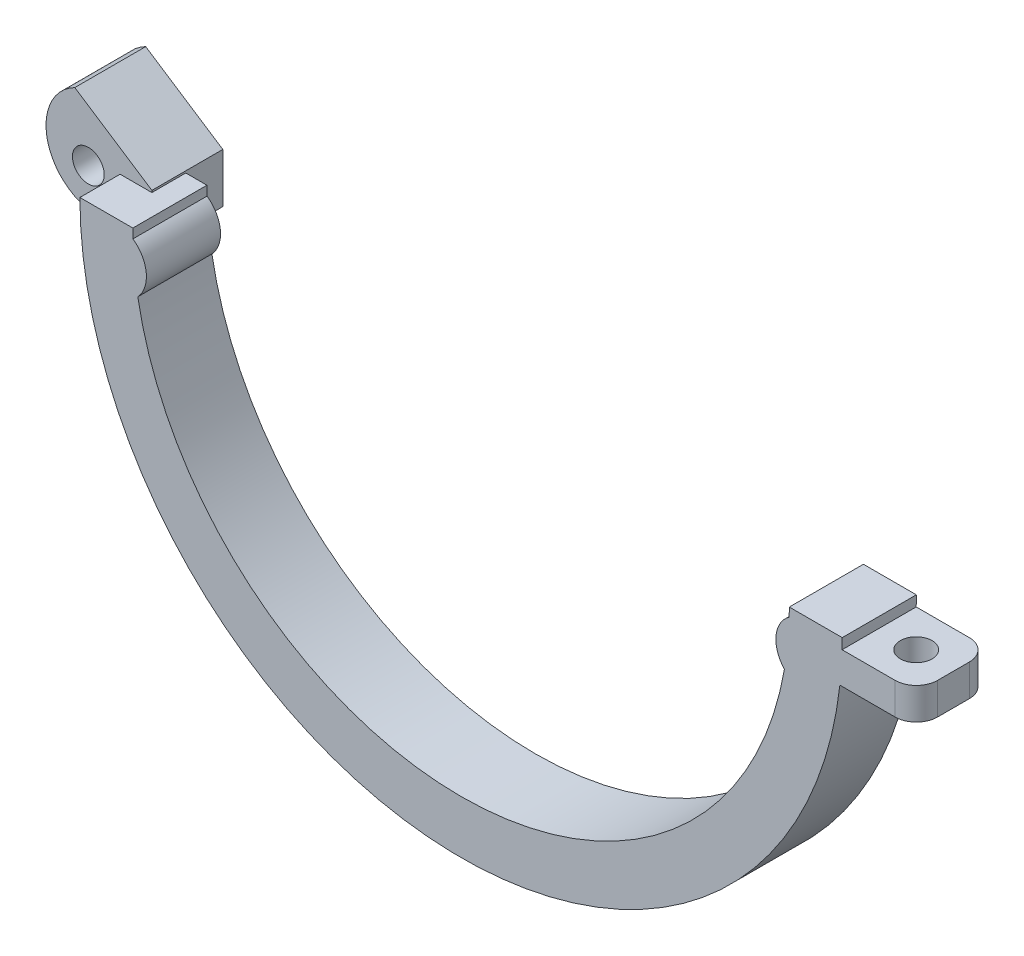
ISO-10303-21;
HEADER;
FILE_DESCRIPTION(('STEP AP214'),'2;1');
FILE_NAME('part.step','',(''),(''),'','','');
FILE_SCHEMA(('AUTOMOTIVE_DESIGN { 1 0 10303 214 1 1 1 1 }'));
ENDSEC;
DATA;
#1=APPLICATION_CONTEXT('core data for automotive mechanical design processes');
#2=APPLICATION_PROTOCOL_DEFINITION('international standard','automotive_design',2000,#1);
#3=PRODUCT_CONTEXT('',#1,'mechanical');
#4=PRODUCT('Part','Part','',(#3));
#5=PRODUCT_RELATED_PRODUCT_CATEGORY('part','',(#4));
#6=PRODUCT_DEFINITION_FORMATION('','',#4);
#7=PRODUCT_DEFINITION_CONTEXT('part definition',#1,'design');
#8=PRODUCT_DEFINITION('design','',#6,#7);
#9=PRODUCT_DEFINITION_SHAPE('','',#8);
#10=(LENGTH_UNIT() NAMED_UNIT(*) SI_UNIT(.MILLI.,.METRE.));
#11=(NAMED_UNIT(*) PLANE_ANGLE_UNIT() SI_UNIT($,.RADIAN.));
#12=(NAMED_UNIT(*) SI_UNIT($,.STERADIAN.) SOLID_ANGLE_UNIT());
#13=UNCERTAINTY_MEASURE_WITH_UNIT(LENGTH_MEASURE(1.E-05),#10,'distance_accuracy_value','');
#14=(GEOMETRIC_REPRESENTATION_CONTEXT(3) GLOBAL_UNCERTAINTY_ASSIGNED_CONTEXT((#13)) GLOBAL_UNIT_ASSIGNED_CONTEXT((#10,
#11,#12)) REPRESENTATION_CONTEXT('',''));
#15=CARTESIAN_POINT('',(0.,0.,0.));
#16=DIRECTION('',(0.,0.,1.));
#17=DIRECTION('',(1.,0.,0.));
#18=AXIS2_PLACEMENT_3D('',#15,#16,#17);
#19=CARTESIAN_POINT('',(41.,-3.99999999999988,2.));
#20=DIRECTION('',(0.,-1.,0.));
#21=DIRECTION('',(0.,0.,-1.));
#22=AXIS2_PLACEMENT_3D('',#19,#20,#21);
#23=CYLINDRICAL_SURFACE('',#22,2.);
#24=DIRECTION('',(0.,1.,0.));
#25=VECTOR('',#24,1.);
#26=CARTESIAN_POINT('',(43.,-3.99999999999988,2.));
#27=LINE('',#26,#25);
#28=CARTESIAN_POINT('',(43.,-3.99999999999988,2.));
#29=VERTEX_POINT('',#28);
#30=CARTESIAN_POINT('',(43.,-0.99999999999988,2.));
#31=VERTEX_POINT('',#30);
#32=EDGE_CURVE('E301',#29,#31,#27,.T.);
#33=ORIENTED_EDGE('',*,*,#32,.F.);
#34=CARTESIAN_POINT('',(41.,-3.99999999999988,2.));
#35=DIRECTION('',(0.,-1.,0.));
#36=DIRECTION('',(1.,0.,0.));
#37=AXIS2_PLACEMENT_3D('',#34,#35,#36);
#38=CIRCLE('',#37,2.);
#39=CARTESIAN_POINT('',(41.,-3.99999999999988,0.));
#40=VERTEX_POINT('',#39);
#41=EDGE_CURVE('E56',#40,#29,#38,.T.);
#42=ORIENTED_EDGE('',*,*,#41,.F.);
#43=DIRECTION('',(0.,1.,0.));
#44=VECTOR('',#43,1.);
#45=CARTESIAN_POINT('',(41.,-3.99999999999988,0.));
#46=LINE('',#45,#44);
#47=CARTESIAN_POINT('',(41.,-0.999999999999881,0.));
#48=VERTEX_POINT('',#47);
#49=EDGE_CURVE('E304',#48,#40,#46,.F.);
#50=ORIENTED_EDGE('',*,*,#49,.F.);
#51=CARTESIAN_POINT('',(41.,-0.999999999999881,2.));
#52=DIRECTION('',(0.,1.,0.));
#53=DIRECTION('',(-1.,0.,0.));
#54=AXIS2_PLACEMENT_3D('',#51,#52,#53);
#55=CIRCLE('',#54,2.);
#56=EDGE_CURVE('E42',#31,#48,#55,.T.);
#57=ORIENTED_EDGE('',*,*,#56,.F.);
#58=EDGE_LOOP('',(#33,#42,#50,#57));
#59=FACE_BOUND('',#58,.T.);
#60=ADVANCED_FACE('F35',(#59),#23,.T.);
#61=CARTESIAN_POINT('',(41.,0.,5.));
#62=DIRECTION('',(0.,1.,0.));
#63=DIRECTION('',(0.,0.,1.));
#64=AXIS2_PLACEMENT_3D('',#61,#62,#63);
#65=CYLINDRICAL_SURFACE('',#64,2.);
#66=DIRECTION('',(0.,1.,0.));
#67=VECTOR('',#66,1.);
#68=CARTESIAN_POINT('',(41.,0.,7.));
#69=LINE('',#68,#67);
#70=CARTESIAN_POINT('',(41.,-3.99999999999988,7.));
#71=VERTEX_POINT('',#70);
#72=CARTESIAN_POINT('',(41.,-0.999999999999881,7.));
#73=VERTEX_POINT('',#72);
#74=EDGE_CURVE('E290',#71,#73,#69,.T.);
#75=ORIENTED_EDGE('',*,*,#74,.F.);
#76=CARTESIAN_POINT('',(41.,-3.99999999999988,5.));
#77=DIRECTION('',(0.,-1.,0.));
#78=DIRECTION('',(1.,0.,0.));
#79=AXIS2_PLACEMENT_3D('',#76,#77,#78);
#80=CIRCLE('',#79,2.);
#81=CARTESIAN_POINT('',(43.,-3.99999999999988,5.));
#82=VERTEX_POINT('',#81);
#83=EDGE_CURVE('E296',#82,#71,#80,.T.);
#84=ORIENTED_EDGE('',*,*,#83,.F.);
#85=DIRECTION('',(0.,1.,0.));
#86=VECTOR('',#85,1.);
#87=CARTESIAN_POINT('',(43.,-3.99999999999988,5.));
#88=LINE('',#87,#86);
#89=CARTESIAN_POINT('',(43.,-0.99999999999988,5.));
#90=VERTEX_POINT('',#89);
#91=EDGE_CURVE('E293',#90,#82,#88,.F.);
#92=ORIENTED_EDGE('',*,*,#91,.F.);
#93=CARTESIAN_POINT('',(41.,-0.999999999999881,5.));
#94=DIRECTION('',(0.,1.,0.));
#95=DIRECTION('',(-1.,0.,0.));
#96=AXIS2_PLACEMENT_3D('',#93,#94,#95);
#97=CIRCLE('',#96,2.);
#98=EDGE_CURVE('E298',#73,#90,#97,.T.);
#99=ORIENTED_EDGE('',*,*,#98,.F.);
#100=EDGE_LOOP('',(#75,#84,#92,#99));
#101=FACE_BOUND('',#100,.T.);
#102=ADVANCED_FACE('F402',(#101),#65,.T.);
#103=CARTESIAN_POINT('',(0.,0.,7.));
#104=DIRECTION('',(0.,0.,-1.));
#105=DIRECTION('',(-1.,0.,0.));
#106=AXIS2_PLACEMENT_3D('',#103,#104,#105);
#107=CYLINDRICAL_SURFACE('',#106,36.);
#108=CARTESIAN_POINT('',(0.,0.,0.));
#109=DIRECTION('',(0.,0.,1.));
#110=DIRECTION('',(1.,0.,0.));
#111=AXIS2_PLACEMENT_3D('',#108,#109,#110);
#112=CIRCLE('',#111,36.);
#113=CARTESIAN_POINT('',(-35.717642699372,-4.50000000000014,0.));
#114=VERTEX_POINT('',#113);
#115=CARTESIAN_POINT('',(35.7770876399966,-3.99999999999988,0.));
#116=VERTEX_POINT('',#115);
#117=EDGE_CURVE('E248',#114,#116,#112,.T.);
#118=ORIENTED_EDGE('',*,*,#117,.T.);
#119=DIRECTION('',(0.,0.,-1.));
#120=VECTOR('',#119,1.);
#121=CARTESIAN_POINT('',(35.7770876399966,-3.99999999999988,7.));
#122=LINE('',#121,#120);
#123=CARTESIAN_POINT('',(35.7770876399966,-3.99999999999988,7.));
#124=VERTEX_POINT('',#123);
#125=EDGE_CURVE('E337',#116,#124,#122,.F.);
#126=ORIENTED_EDGE('',*,*,#125,.T.);
#127=CARTESIAN_POINT('',(0.,0.,7.));
#128=DIRECTION('',(0.,0.,1.));
#129=DIRECTION('',(1.,0.,0.));
#130=AXIS2_PLACEMENT_3D('',#127,#128,#129);
#131=CIRCLE('',#130,36.);
#132=CARTESIAN_POINT('',(-36.,-1.38919513629144E-13,7.));
#133=VERTEX_POINT('',#132);
#134=EDGE_CURVE('E232',#133,#124,#131,.T.);
#135=ORIENTED_EDGE('',*,*,#134,.F.);
#136=DIRECTION('',(0.,0.,-1.));
#137=VECTOR('',#136,1.);
#138=CARTESIAN_POINT('',(-36.,-1.38919513629144E-13,7.));
#139=LINE('',#138,#137);
#140=CARTESIAN_POINT('',(-36.,-1.38919513629144E-13,3.2));
#141=VERTEX_POINT('',#140);
#142=EDGE_CURVE('E256',#133,#141,#139,.T.);
#143=ORIENTED_EDGE('',*,*,#142,.T.);
#144=CARTESIAN_POINT('',(0.,0.,3.2));
#145=DIRECTION('',(0.,0.,1.));
#146=DIRECTION('',(1.,0.,0.));
#147=AXIS2_PLACEMENT_3D('',#144,#145,#146);
#148=CIRCLE('',#147,36.);
#149=CARTESIAN_POINT('',(-35.717642699372,-4.50000000000014,3.2));
#150=VERTEX_POINT('',#149);
#151=EDGE_CURVE('E275',#141,#150,#148,.T.);
#152=ORIENTED_EDGE('',*,*,#151,.T.);
#153=DIRECTION('',(0.,0.,-1.));
#154=VECTOR('',#153,1.);
#155=CARTESIAN_POINT('',(-35.717642699372,-4.50000000000014,7.));
#156=LINE('',#155,#154);
#157=EDGE_CURVE('E207',#114,#150,#156,.F.);
#158=ORIENTED_EDGE('',*,*,#157,.F.);
#159=EDGE_LOOP('',(#118,#126,#135,#143,#152,#158));
#160=FACE_BOUND('',#159,.T.);
#161=ADVANCED_FACE('F356',(#160),#107,.T.);
#162=CARTESIAN_POINT('',(-38.,0.499999999999861,-3.5));
#163=DIRECTION('',(0.,0.,-1.));
#164=DIRECTION('',(-1.,0.,0.));
#165=AXIS2_PLACEMENT_3D('',#162,#163,#164);
#166=CYLINDRICAL_SURFACE('',#165,5.);
#167=DIRECTION('',(0.,0.,-1.));
#168=VECTOR('',#167,1.);
#169=CARTESIAN_POINT('',(-38.,-4.50000000000014,-3.5));
#170=LINE('',#169,#168);
#171=CARTESIAN_POINT('',(-38.,-4.50000000000014,3.2));
#172=VERTEX_POINT('',#171);
#173=CARTESIAN_POINT('',(-38.,-4.50000000000014,-3.5));
#174=VERTEX_POINT('',#173);
#175=EDGE_CURVE('E283',#172,#174,#170,.T.);
#176=ORIENTED_EDGE('',*,*,#175,.F.);
#177=CARTESIAN_POINT('',(-38.,0.499999999999861,3.2));
#178=DIRECTION('',(0.,0.,1.));
#179=DIRECTION('',(1.,0.,0.));
#180=AXIS2_PLACEMENT_3D('',#177,#178,#179);
#181=CIRCLE('',#180,5.);
#182=CARTESIAN_POINT('',(-43.,0.499999999999861,3.2));
#183=VERTEX_POINT('',#182);
#184=EDGE_CURVE('E286',#183,#172,#181,.T.);
#185=ORIENTED_EDGE('',*,*,#184,.F.);
#186=DIRECTION('',(0.,0.,-1.));
#187=VECTOR('',#186,1.);
#188=CARTESIAN_POINT('',(-43.,0.499999999999861,-3.5));
#189=LINE('',#188,#187);
#190=CARTESIAN_POINT('',(-43.,0.499999999999861,-3.5));
#191=VERTEX_POINT('',#190);
#192=EDGE_CURVE('E277',#183,#191,#189,.T.);
#193=ORIENTED_EDGE('',*,*,#192,.T.);
#194=CARTESIAN_POINT('',(-38.,0.499999999999861,-3.5));
#195=DIRECTION('',(0.,0.,1.));
#196=DIRECTION('',(1.,0.,0.));
#197=AXIS2_PLACEMENT_3D('',#194,#195,#196);
#198=CIRCLE('',#197,5.);
#199=EDGE_CURVE('E288',#174,#191,#198,.F.);
#200=ORIENTED_EDGE('',*,*,#199,.F.);
#201=EDGE_LOOP('',(#176,#185,#193,#200));
#202=FACE_BOUND('',#201,.T.);
#203=ADVANCED_FACE('F428',(#202),#166,.T.);
#204=CARTESIAN_POINT('',(-38.,0.499999999999861,-3.5));
#205=DIRECTION('',(0.,0.,-1.));
#206=DIRECTION('',(-1.,0.,0.));
#207=AXIS2_PLACEMENT_3D('',#204,#205,#206);
#208=CYLINDRICAL_SURFACE('',#207,5.);
#209=DIRECTION('',(0.,0.,-1.));
#210=VECTOR('',#209,1.);
#211=CARTESIAN_POINT('',(-40.2798012873395,4.95000068429703,3.49999999999999));
#212=LINE('',#211,#210);
#213=CARTESIAN_POINT('',(-40.2798012873395,4.95000068429703,3.2));
#214=VERTEX_POINT('',#213);
#215=CARTESIAN_POINT('',(-40.2798012873395,4.95000068429703,-3.5));
#216=VERTEX_POINT('',#215);
#217=EDGE_CURVE('E48',#214,#216,#212,.T.);
#218=ORIENTED_EDGE('',*,*,#217,.T.);
#219=CARTESIAN_POINT('',(-38.,0.499999999999861,-3.5));
#220=DIRECTION('',(0.,0.,1.));
#221=DIRECTION('',(1.,0.,0.));
#222=AXIS2_PLACEMENT_3D('',#219,#220,#221);
#223=CIRCLE('',#222,5.);
#224=EDGE_CURVE('E190',#191,#216,#223,.F.);
#225=ORIENTED_EDGE('',*,*,#224,.F.);
#226=ORIENTED_EDGE('',*,*,#192,.F.);
#227=CARTESIAN_POINT('',(-38.,0.499999999999861,3.2));
#228=DIRECTION('',(0.,0.,1.));
#229=DIRECTION('',(1.,0.,0.));
#230=AXIS2_PLACEMENT_3D('',#227,#228,#229);
#231=CIRCLE('',#230,5.);
#232=EDGE_CURVE('E280',#214,#183,#231,.T.);
#233=ORIENTED_EDGE('',*,*,#232,.F.);
#234=EDGE_LOOP('',(#218,#225,#226,#233));
#235=FACE_BOUND('',#234,.T.);
#236=ADVANCED_FACE('F433',(#235),#208,.T.);
#237=CARTESIAN_POINT('',(0.,0.,7.));
#238=DIRECTION('',(0.,1.,0.));
#239=DIRECTION('',(-1.,0.,0.));
#240=AXIS2_PLACEMENT_3D('',#237,#238,#239);
#241=PLANE('',#240);
#242=DIRECTION('',(1.,0.,0.));
#243=VECTOR('',#242,1.);
#244=CARTESIAN_POINT('',(0.,0.,0.));
#245=LINE('',#244,#243);
#246=CARTESIAN_POINT('',(-33.,-1.27342887493382E-13,0.));
#247=VERTEX_POINT('',#246);
#248=CARTESIAN_POINT('',(-31.,-1.19625136736208E-13,0.));
#249=VERTEX_POINT('',#248);
#250=EDGE_CURVE('E245',#247,#249,#245,.T.);
#251=ORIENTED_EDGE('',*,*,#250,.F.);
#252=DIRECTION('',(0.,0.,1.));
#253=VECTOR('',#252,1.);
#254=CARTESIAN_POINT('',(-33.,-1.27342887493382E-13,7.));
#255=LINE('',#254,#253);
#256=CARTESIAN_POINT('',(-33.,-1.27342887493382E-13,3.2));
#257=VERTEX_POINT('',#256);
#258=EDGE_CURVE('E210',#247,#257,#255,.T.);
#259=ORIENTED_EDGE('',*,*,#258,.T.);
#260=DIRECTION('',(1.,0.,0.));
#261=VECTOR('',#260,1.);
#262=CARTESIAN_POINT('',(0.,0.,3.2));
#263=LINE('',#262,#261);
#264=EDGE_CURVE('E213',#141,#257,#263,.T.);
#265=ORIENTED_EDGE('',*,*,#264,.F.);
#266=ORIENTED_EDGE('',*,*,#142,.F.);
#267=DIRECTION('',(1.,0.,0.));
#268=VECTOR('',#267,1.);
#269=CARTESIAN_POINT('',(0.,0.,7.));
#270=LINE('',#269,#268);
#271=CARTESIAN_POINT('',(-31.,-1.19625136736208E-13,7.));
#272=VERTEX_POINT('',#271);
#273=EDGE_CURVE('E227',#133,#272,#270,.T.);
#274=ORIENTED_EDGE('',*,*,#273,.T.);
#275=DIRECTION('',(0.,0.,-1.));
#276=VECTOR('',#275,1.);
#277=CARTESIAN_POINT('',(-31.,-1.19625136736208E-13,7.));
#278=LINE('',#277,#276);
#279=EDGE_CURVE('E259',#272,#249,#278,.T.);
#280=ORIENTED_EDGE('',*,*,#279,.T.);
#281=EDGE_LOOP('',(#251,#259,#265,#266,#274,#280));
#282=FACE_BOUND('',#281,.T.);
#283=ADVANCED_FACE('F349',(#282),#241,.T.);
#284=CARTESIAN_POINT('',(35.9861084308932,-0.999999999999881,7.));
#285=VERTEX_POINT('',#284);
#286=CARTESIAN_POINT('',(36.,1.38919513629144E-13,7.));
#287=VERTEX_POINT('',#286);
#288=EDGE_CURVE('E230',#285,#287,#131,.T.);
#289=ORIENTED_EDGE('',*,*,#288,.F.);
#290=DIRECTION('',(0.,0.,-1.));
#291=VECTOR('',#290,1.);
#292=CARTESIAN_POINT('',(35.9861084308932,-0.999999999999881,7.));
#293=LINE('',#292,#291);
#294=CARTESIAN_POINT('',(35.9861084308932,-0.999999999999881,0.));
#295=VERTEX_POINT('',#294);
#296=EDGE_CURVE('E334',#285,#295,#293,.T.);
#297=ORIENTED_EDGE('',*,*,#296,.T.);
#298=CARTESIAN_POINT('',(36.,1.38919513629144E-13,0.));
#299=VERTEX_POINT('',#298);
#300=EDGE_CURVE('E247',#295,#299,#112,.T.);
#301=ORIENTED_EDGE('',*,*,#300,.T.);
#302=DIRECTION('',(0.,0.,-1.));
#303=VECTOR('',#302,1.);
#304=CARTESIAN_POINT('',(36.,1.38919513629144E-13,7.));
#305=LINE('',#304,#303);
#306=EDGE_CURVE('E253',#287,#299,#305,.T.);
#307=ORIENTED_EDGE('',*,*,#306,.F.);
#308=EDGE_LOOP('',(#289,#297,#301,#307));
#309=FACE_BOUND('',#308,.T.);
#310=ADVANCED_FACE('F396',(#309),#107,.T.);
#311=CARTESIAN_POINT('',(0.,0.,0.));
#312=DIRECTION('',(0.,0.,1.));
#313=DIRECTION('',(1.,0.,0.));
#314=AXIS2_PLACEMENT_3D('',#311,#312,#313);
#315=PLANE('',#314);
#316=DIRECTION('',(-1.,0.,0.));
#317=VECTOR('',#316,1.);
#318=CARTESIAN_POINT('',(43.,-0.99999999999988,0.));
#319=LINE('',#318,#317);
#320=EDGE_CURVE('E311',#48,#295,#319,.T.);
#321=ORIENTED_EDGE('',*,*,#320,.F.);
#322=ORIENTED_EDGE('',*,*,#49,.T.);
#323=DIRECTION('',(1.,0.,0.));
#324=VECTOR('',#323,1.);
#325=CARTESIAN_POINT('',(43.,-3.99999999999988,0.));
#326=LINE('',#325,#324);
#327=EDGE_CURVE('E320',#116,#40,#326,.T.);
#328=ORIENTED_EDGE('',*,*,#327,.F.);
#329=ORIENTED_EDGE('',*,*,#117,.F.);
#330=DIRECTION('',(-1.,0.,0.));
#331=VECTOR('',#330,1.);
#332=CARTESIAN_POINT('',(0.,-4.50000000000014,0.));
#333=LINE('',#332,#331);
#334=CARTESIAN_POINT('',(-33.,-4.50000000000014,0.));
#335=VERTEX_POINT('',#334);
#336=EDGE_CURVE('E270',#335,#114,#333,.T.);
#337=ORIENTED_EDGE('',*,*,#336,.F.);
#338=DIRECTION('',(0.,-1.,0.));
#339=VECTOR('',#338,1.);
#340=CARTESIAN_POINT('',(-33.,0.,0.));
#341=LINE('',#340,#339);
#342=EDGE_CURVE('E273',#247,#335,#341,.T.);
#343=ORIENTED_EDGE('',*,*,#342,.F.);
#344=ORIENTED_EDGE('',*,*,#250,.T.);
#345=CARTESIAN_POINT('',(0.,0.,0.));
#346=DIRECTION('',(0.,0.,1.));
#347=DIRECTION('',(1.,0.,0.));
#348=AXIS2_PLACEMENT_3D('',#345,#346,#347);
#349=CIRCLE('',#348,31.);
#350=CARTESIAN_POINT('',(-30.9874565828908,-0.881779180666261,0.));
#351=VERTEX_POINT('',#350);
#352=EDGE_CURVE('E238',#249,#351,#349,.T.);
#353=ORIENTED_EDGE('',*,*,#352,.T.);
#354=CARTESIAN_POINT('',(-32.7162886303256,-3.33354176129319,0.));
#355=DIRECTION('',(0.,0.,1.));
#356=DIRECTION('',(1.,0.,0.));
#357=AXIS2_PLACEMENT_3D('',#354,#355,#356);
#358=CIRCLE('',#357,3.);
#359=CARTESIAN_POINT('',(-30.5284872887118,-5.38622909492017,0.));
#360=VERTEX_POINT('',#359);
#361=EDGE_CURVE('E242',#360,#351,#358,.T.);
#362=ORIENTED_EDGE('',*,*,#361,.F.);
#363=CARTESIAN_POINT('',(30.539836630561,-5.32150153421428,0.));
#364=VERTEX_POINT('',#363);
#365=EDGE_CURVE('E239',#360,#364,#349,.T.);
#366=ORIENTED_EDGE('',*,*,#365,.T.);
#367=CARTESIAN_POINT('',(32.7312790320065,-3.2727018365506,0.));
#368=DIRECTION('',(0.,0.,1.));
#369=DIRECTION('',(1.,0.,0.));
#370=AXIS2_PLACEMENT_3D('',#367,#368,#369);
#371=CIRCLE('',#370,3.);
#372=CARTESIAN_POINT('',(30.9888714898245,-0.830568351880452,0.));
#373=VERTEX_POINT('',#372);
#374=EDGE_CURVE('E237',#373,#364,#371,.T.);
#375=ORIENTED_EDGE('',*,*,#374,.F.);
#376=CARTESIAN_POINT('',(31.,1.19625136736207E-13,0.));
#377=VERTEX_POINT('',#376);
#378=EDGE_CURVE('E216',#373,#377,#349,.T.);
#379=ORIENTED_EDGE('',*,*,#378,.T.);
#380=EDGE_CURVE('E221',#377,#299,#245,.T.);
#381=ORIENTED_EDGE('',*,*,#380,.T.);
#382=ORIENTED_EDGE('',*,*,#300,.F.);
#383=EDGE_LOOP('',(#321,#322,#328,#329,#337,#343,#344,#353,#362,#366,#375,#379,#381,#382));
#384=FACE_BOUND('',#383,.T.);
#385=ADVANCED_FACE('F318',(#384),#315,.F.);
#386=CARTESIAN_POINT('',(0.,0.,7.));
#387=DIRECTION('',(0.,0.,-1.));
#388=DIRECTION('',(-1.,0.,0.));
#389=AXIS2_PLACEMENT_3D('',#386,#387,#388);
#390=CYLINDRICAL_SURFACE('',#389,31.);
#391=ORIENTED_EDGE('',*,*,#378,.F.);
#392=DIRECTION('',(0.,0.,-1.));
#393=VECTOR('',#392,1.);
#394=CARTESIAN_POINT('',(30.9888714898245,-0.830568351880452,7.));
#395=LINE('',#394,#393);
#396=CARTESIAN_POINT('',(30.9888714898245,-0.830568351880452,7.));
#397=VERTEX_POINT('',#396);
#398=EDGE_CURVE('E268',#397,#373,#395,.T.);
#399=ORIENTED_EDGE('',*,*,#398,.F.);
#400=CARTESIAN_POINT('',(0.,0.,7.));
#401=DIRECTION('',(0.,0.,1.));
#402=DIRECTION('',(1.,0.,0.));
#403=AXIS2_PLACEMENT_3D('',#400,#401,#402);
#404=CIRCLE('',#403,31.);
#405=CARTESIAN_POINT('',(31.,1.19625136736207E-13,7.));
#406=VERTEX_POINT('',#405);
#407=EDGE_CURVE('E217',#397,#406,#404,.T.);
#408=ORIENTED_EDGE('',*,*,#407,.T.);
#409=DIRECTION('',(0.,0.,-1.));
#410=VECTOR('',#409,1.);
#411=CARTESIAN_POINT('',(31.,1.19625136736207E-13,7.));
#412=LINE('',#411,#410);
#413=EDGE_CURVE('E251',#406,#377,#412,.T.);
#414=ORIENTED_EDGE('',*,*,#413,.T.);
#415=EDGE_LOOP('',(#391,#399,#408,#414));
#416=FACE_BOUND('',#415,.T.);
#417=ADVANCED_FACE('F387',(#416),#390,.F.);
#418=CARTESIAN_POINT('',(32.7312790320065,-3.2727018365506,7.));
#419=DIRECTION('',(0.,0.,-1.));
#420=DIRECTION('',(-1.,0.,0.));
#421=AXIS2_PLACEMENT_3D('',#418,#419,#420);
#422=CYLINDRICAL_SURFACE('',#421,3.);
#423=ORIENTED_EDGE('',*,*,#374,.T.);
#424=DIRECTION('',(0.,0.,-1.));
#425=VECTOR('',#424,1.);
#426=CARTESIAN_POINT('',(30.539836630561,-5.32150153421428,7.));
#427=LINE('',#426,#425);
#428=CARTESIAN_POINT('',(30.539836630561,-5.32150153421428,7.));
#429=VERTEX_POINT('',#428);
#430=EDGE_CURVE('E266',#429,#364,#427,.T.);
#431=ORIENTED_EDGE('',*,*,#430,.F.);
#432=CARTESIAN_POINT('',(32.7312790320065,-3.2727018365506,7.));
#433=DIRECTION('',(0.,0.,1.));
#434=DIRECTION('',(1.,0.,0.));
#435=AXIS2_PLACEMENT_3D('',#432,#433,#434);
#436=CIRCLE('',#435,3.);
#437=EDGE_CURVE('E220',#397,#429,#436,.T.);
#438=ORIENTED_EDGE('',*,*,#437,.F.);
#439=ORIENTED_EDGE('',*,*,#398,.T.);
#440=EDGE_LOOP('',(#423,#431,#438,#439));
#441=FACE_BOUND('',#440,.T.);
#442=ADVANCED_FACE('F384',(#441),#422,.T.);
#443=ORIENTED_EDGE('',*,*,#365,.F.);
#444=DIRECTION('',(0.,0.,-1.));
#445=VECTOR('',#444,1.);
#446=CARTESIAN_POINT('',(-30.5284872887118,-5.38622909492017,7.));
#447=LINE('',#446,#445);
#448=CARTESIAN_POINT('',(-30.5284872887118,-5.38622909492017,7.));
#449=VERTEX_POINT('',#448);
#450=EDGE_CURVE('E264',#449,#360,#447,.T.);
#451=ORIENTED_EDGE('',*,*,#450,.F.);
#452=EDGE_CURVE('E223',#449,#429,#404,.T.);
#453=ORIENTED_EDGE('',*,*,#452,.T.);
#454=ORIENTED_EDGE('',*,*,#430,.T.);
#455=EDGE_LOOP('',(#443,#451,#453,#454));
#456=FACE_BOUND('',#455,.T.);
#457=ADVANCED_FACE('F377',(#456),#390,.F.);
#458=CARTESIAN_POINT('',(-32.7162886303256,-3.33354176129319,7.));
#459=DIRECTION('',(0.,0.,-1.));
#460=DIRECTION('',(-1.,0.,0.));
#461=AXIS2_PLACEMENT_3D('',#458,#459,#460);
#462=CYLINDRICAL_SURFACE('',#461,3.);
#463=ORIENTED_EDGE('',*,*,#361,.T.);
#464=DIRECTION('',(0.,0.,-1.));
#465=VECTOR('',#464,1.);
#466=CARTESIAN_POINT('',(-30.9874565828908,-0.881779180666261,7.));
#467=LINE('',#466,#465);
#468=CARTESIAN_POINT('',(-30.9874565828908,-0.881779180666261,7.));
#469=VERTEX_POINT('',#468);
#470=EDGE_CURVE('E262',#469,#351,#467,.T.);
#471=ORIENTED_EDGE('',*,*,#470,.F.);
#472=CARTESIAN_POINT('',(-32.7162886303256,-3.33354176129319,7.));
#473=DIRECTION('',(0.,0.,1.));
#474=DIRECTION('',(1.,0.,0.));
#475=AXIS2_PLACEMENT_3D('',#472,#473,#474);
#476=CIRCLE('',#475,3.);
#477=EDGE_CURVE('E225',#449,#469,#476,.T.);
#478=ORIENTED_EDGE('',*,*,#477,.F.);
#479=ORIENTED_EDGE('',*,*,#450,.T.);
#480=EDGE_LOOP('',(#463,#471,#478,#479));
#481=FACE_BOUND('',#480,.T.);
#482=ADVANCED_FACE('F440',(#481),#462,.T.);
#483=ORIENTED_EDGE('',*,*,#352,.F.);
#484=ORIENTED_EDGE('',*,*,#279,.F.);
#485=EDGE_CURVE('E222',#272,#469,#404,.T.);
#486=ORIENTED_EDGE('',*,*,#485,.T.);
#487=ORIENTED_EDGE('',*,*,#470,.T.);
#488=EDGE_LOOP('',(#483,#484,#486,#487));
#489=FACE_BOUND('',#488,.T.);
#490=ADVANCED_FACE('F369',(#489),#390,.F.);
#491=ORIENTED_EDGE('',*,*,#380,.F.);
#492=ORIENTED_EDGE('',*,*,#413,.F.);
#493=EDGE_CURVE('E231',#406,#287,#270,.T.);
#494=ORIENTED_EDGE('',*,*,#493,.T.);
#495=ORIENTED_EDGE('',*,*,#306,.T.);
#496=EDGE_LOOP('',(#491,#492,#494,#495));
#497=FACE_BOUND('',#496,.T.);
#498=ADVANCED_FACE('F391',(#497),#241,.T.);
#499=CARTESIAN_POINT('',(0.,0.,7.));
#500=DIRECTION('',(0.,0.,1.));
#501=DIRECTION('',(1.,0.,0.));
#502=AXIS2_PLACEMENT_3D('',#499,#500,#501);
#503=PLANE('',#502);
#504=DIRECTION('',(1.,0.,0.));
#505=VECTOR('',#504,1.);
#506=CARTESIAN_POINT('',(43.,-3.99999999999988,7.));
#507=LINE('',#506,#505);
#508=EDGE_CURVE('E321',#124,#71,#507,.T.);
#509=ORIENTED_EDGE('',*,*,#508,.T.);
#510=ORIENTED_EDGE('',*,*,#74,.T.);
#511=DIRECTION('',(-1.,0.,0.));
#512=VECTOR('',#511,1.);
#513=CARTESIAN_POINT('',(43.,-0.99999999999988,7.));
#514=LINE('',#513,#512);
#515=EDGE_CURVE('E325',#73,#285,#514,.T.);
#516=ORIENTED_EDGE('',*,*,#515,.T.);
#517=ORIENTED_EDGE('',*,*,#288,.T.);
#518=ORIENTED_EDGE('',*,*,#493,.F.);
#519=ORIENTED_EDGE('',*,*,#407,.F.);
#520=ORIENTED_EDGE('',*,*,#437,.T.);
#521=ORIENTED_EDGE('',*,*,#452,.F.);
#522=ORIENTED_EDGE('',*,*,#477,.T.);
#523=ORIENTED_EDGE('',*,*,#485,.F.);
#524=ORIENTED_EDGE('',*,*,#273,.F.);
#525=ORIENTED_EDGE('',*,*,#134,.T.);
#526=EDGE_LOOP('',(#509,#510,#516,#517,#518,#519,#520,#521,#522,#523,#524,#525));
#527=FACE_BOUND('',#526,.T.);
#528=ADVANCED_FACE('F363',(#527),#503,.T.);
#529=CARTESIAN_POINT('',(-33.,-4.50000000000014,-3.5));
#530=DIRECTION('',(0.,1.,0.));
#531=DIRECTION('',(0.,0.,1.));
#532=AXIS2_PLACEMENT_3D('',#529,#530,#531);
#533=PLANE('',#532);
#534=DIRECTION('',(-1.,0.,0.));
#535=VECTOR('',#534,1.);
#536=CARTESIAN_POINT('',(-33.,-4.50000000000014,3.2));
#537=LINE('',#536,#535);
#538=EDGE_CURVE('E198',#150,#172,#537,.T.);
#539=ORIENTED_EDGE('',*,*,#538,.T.);
#540=ORIENTED_EDGE('',*,*,#175,.T.);
#541=DIRECTION('',(-1.,0.,0.));
#542=VECTOR('',#541,1.);
#543=CARTESIAN_POINT('',(-33.,-4.50000000000014,-3.5));
#544=LINE('',#543,#542);
#545=CARTESIAN_POINT('',(-33.,-4.50000000000014,-3.5));
#546=VERTEX_POINT('',#545);
#547=EDGE_CURVE('E197',#546,#174,#544,.T.);
#548=ORIENTED_EDGE('',*,*,#547,.F.);
#549=DIRECTION('',(0.,0.,1.));
#550=VECTOR('',#549,1.);
#551=CARTESIAN_POINT('',(-33.,-4.50000000000014,-3.5));
#552=LINE('',#551,#550);
#553=EDGE_CURVE('E196',#546,#335,#552,.T.);
#554=ORIENTED_EDGE('',*,*,#553,.T.);
#555=ORIENTED_EDGE('',*,*,#336,.T.);
#556=ORIENTED_EDGE('',*,*,#157,.T.);
#557=EDGE_LOOP('',(#539,#540,#548,#554,#555,#556));
#558=FACE_BOUND('',#557,.T.);
#559=ADVANCED_FACE('F359',(#558),#533,.F.);
#560=CARTESIAN_POINT('',(-33.,-4.50000000000014,-3.5));
#561=DIRECTION('',(-1.,0.,0.));
#562=DIRECTION('',(0.,0.,1.));
#563=AXIS2_PLACEMENT_3D('',#560,#561,#562);
#564=PLANE('',#563);
#565=DIRECTION('',(0.,-1.,0.));
#566=VECTOR('',#565,1.);
#567=CARTESIAN_POINT('',(-33.,-4.50000000000014,-3.5));
#568=LINE('',#567,#566);
#569=CARTESIAN_POINT('',(-33.,0.17946233805333,-3.5));
#570=VERTEX_POINT('',#569);
#571=EDGE_CURVE('E187',#570,#546,#568,.T.);
#572=ORIENTED_EDGE('',*,*,#571,.F.);
#573=DIRECTION('',(0.,0.,-1.));
#574=VECTOR('',#573,1.);
#575=CARTESIAN_POINT('',(-33.,0.17946233805333,3.49999999999999));
#576=LINE('',#575,#574);
#577=CARTESIAN_POINT('',(-33.,0.17946233805333,3.2));
#578=VERTEX_POINT('',#577);
#579=EDGE_CURVE('E175',#578,#570,#576,.T.);
#580=ORIENTED_EDGE('',*,*,#579,.F.);
#581=DIRECTION('',(0.,-1.,0.));
#582=VECTOR('',#581,1.);
#583=CARTESIAN_POINT('',(-33.,-4.50000000000014,3.2));
#584=LINE('',#583,#582);
#585=EDGE_CURVE('E202',#578,#257,#584,.T.);
#586=ORIENTED_EDGE('',*,*,#585,.T.);
#587=ORIENTED_EDGE('',*,*,#258,.F.);
#588=ORIENTED_EDGE('',*,*,#342,.T.);
#589=ORIENTED_EDGE('',*,*,#553,.F.);
#590=EDGE_LOOP('',(#572,#580,#586,#587,#588,#589));
#591=FACE_BOUND('',#590,.T.);
#592=ADVANCED_FACE('F193',(#591),#564,.F.);
#593=CARTESIAN_POINT('',(0.,0.,-3.5));
#594=DIRECTION('',(0.,0.,1.));
#595=DIRECTION('',(1.,0.,0.));
#596=AXIS2_PLACEMENT_3D('',#593,#594,#595);
#597=PLANE('',#596);
#598=CARTESIAN_POINT('',(-39.,-0.800000000000139,-3.5));
#599=DIRECTION('',(0.,0.,1.));
#600=DIRECTION('',(1.,0.,0.));
#601=AXIS2_PLACEMENT_3D('',#598,#599,#600);
#602=CIRCLE('',#601,1.5);
#603=CARTESIAN_POINT('',(-37.5,-0.800000000000139,-3.5));
#604=VERTEX_POINT('',#603);
#605=EDGE_CURVE('E343',#604,#604,#602,.T.);
#606=ORIENTED_EDGE('',*,*,#605,.T.);
#607=EDGE_LOOP('',(#606));
#608=FACE_BOUND('',#607,.T.);
#609=ORIENTED_EDGE('',*,*,#224,.T.);
#610=DIRECTION('',(-0.83640775385513,0.548107716868698,0.));
#611=VECTOR('',#610,1.);
#612=CARTESIAN_POINT('',(-9.8316552951961,-15.0030230720192,-3.5));
#613=LINE('',#612,#611);
#614=EDGE_CURVE('E178',#570,#216,#613,.T.);
#615=ORIENTED_EDGE('',*,*,#614,.F.);
#616=ORIENTED_EDGE('',*,*,#571,.T.);
#617=ORIENTED_EDGE('',*,*,#547,.T.);
#618=ORIENTED_EDGE('',*,*,#199,.T.);
#619=EDGE_LOOP('',(#609,#615,#616,#617,#618));
#620=FACE_BOUND('',#619,.T.);
#621=ADVANCED_FACE('F185',(#608,#620),#597,.F.);
#622=CARTESIAN_POINT('',(0.,0.,3.2));
#623=DIRECTION('',(0.,0.,1.));
#624=DIRECTION('',(1.,0.,0.));
#625=AXIS2_PLACEMENT_3D('',#622,#623,#624);
#626=PLANE('',#625);
#627=DIRECTION('',(0.83640775385513,-0.548107716868698,0.));
#628=VECTOR('',#627,1.);
#629=CARTESIAN_POINT('',(-9.8316552951961,-15.0030230720192,3.2));
#630=LINE('',#629,#628);
#631=EDGE_CURVE('E11',#214,#578,#630,.T.);
#632=ORIENTED_EDGE('',*,*,#631,.F.);
#633=ORIENTED_EDGE('',*,*,#232,.T.);
#634=ORIENTED_EDGE('',*,*,#184,.T.);
#635=ORIENTED_EDGE('',*,*,#538,.F.);
#636=ORIENTED_EDGE('',*,*,#151,.F.);
#637=ORIENTED_EDGE('',*,*,#264,.T.);
#638=ORIENTED_EDGE('',*,*,#585,.F.);
#639=EDGE_LOOP('',(#632,#633,#634,#635,#636,#637,#638));
#640=FACE_BOUND('',#639,.T.);
#641=CARTESIAN_POINT('',(-39.,-0.800000000000139,3.2));
#642=DIRECTION('',(0.,0.,1.));
#643=DIRECTION('',(1.,0.,0.));
#644=AXIS2_PLACEMENT_3D('',#641,#642,#643);
#645=CIRCLE('',#644,1.5);
#646=CARTESIAN_POINT('',(-37.5,-0.800000000000139,3.2));
#647=VERTEX_POINT('',#646);
#648=EDGE_CURVE('E340',#647,#647,#645,.T.);
#649=ORIENTED_EDGE('',*,*,#648,.F.);
#650=EDGE_LOOP('',(#649));
#651=FACE_BOUND('',#650,.T.);
#652=ADVANCED_FACE('F351',(#640,#651),#626,.T.);
#653=CARTESIAN_POINT('',(-39.,-0.800000000000139,-6.8));
#654=DIRECTION('',(0.,0.,1.));
#655=DIRECTION('',(1.,0.,0.));
#656=AXIS2_PLACEMENT_3D('',#653,#654,#655);
#657=CYLINDRICAL_SURFACE('',#656,1.5);
#658=ORIENTED_EDGE('',*,*,#648,.T.);
#659=EDGE_LOOP('',(#658));
#660=FACE_BOUND('',#659,.T.);
#661=ORIENTED_EDGE('',*,*,#605,.F.);
#662=EDGE_LOOP('',(#661));
#663=FACE_BOUND('',#662,.T.);
#664=ADVANCED_FACE('F408',(#660,#663),#657,.F.);
#665=CARTESIAN_POINT('',(43.,-3.99999999999988,0.));
#666=DIRECTION('',(0.,-1.,0.));
#667=DIRECTION('',(1.,0.,0.));
#668=AXIS2_PLACEMENT_3D('',#665,#666,#667);
#669=PLANE('',#668);
#670=CARTESIAN_POINT('',(39.4861084308932,-3.99999999999988,3.5));
#671=DIRECTION('',(0.,-1.,0.));
#672=DIRECTION('',(1.,0.,0.));
#673=AXIS2_PLACEMENT_3D('',#670,#671,#672);
#674=CIRCLE('',#673,1.5);
#675=CARTESIAN_POINT('',(40.9861084308932,-3.99999999999988,3.5));
#676=VERTEX_POINT('',#675);
#677=EDGE_CURVE('E328',#676,#676,#674,.T.);
#678=ORIENTED_EDGE('',*,*,#677,.F.);
#679=EDGE_LOOP('',(#678));
#680=FACE_BOUND('',#679,.T.);
#681=ORIENTED_EDGE('',*,*,#327,.T.);
#682=ORIENTED_EDGE('',*,*,#41,.T.);
#683=DIRECTION('',(0.,0.,1.));
#684=VECTOR('',#683,1.);
#685=CARTESIAN_POINT('',(43.,-3.99999999999988,0.));
#686=LINE('',#685,#684);
#687=EDGE_CURVE('E332',#29,#82,#686,.T.);
#688=ORIENTED_EDGE('',*,*,#687,.T.);
#689=ORIENTED_EDGE('',*,*,#83,.T.);
#690=ORIENTED_EDGE('',*,*,#508,.F.);
#691=ORIENTED_EDGE('',*,*,#125,.F.);
#692=EDGE_LOOP('',(#681,#682,#688,#689,#690,#691));
#693=FACE_BOUND('',#692,.T.);
#694=ADVANCED_FACE('F406',(#680,#693),#669,.T.);
#695=CARTESIAN_POINT('',(43.,-0.99999999999988,0.));
#696=DIRECTION('',(0.,1.,0.));
#697=DIRECTION('',(-1.,0.,0.));
#698=AXIS2_PLACEMENT_3D('',#695,#696,#697);
#699=PLANE('',#698);
#700=CARTESIAN_POINT('',(39.4861084308932,-0.999999999999881,3.5));
#701=DIRECTION('',(0.,1.,0.));
#702=DIRECTION('',(-1.,0.,0.));
#703=AXIS2_PLACEMENT_3D('',#700,#701,#702);
#704=CIRCLE('',#703,1.5);
#705=CARTESIAN_POINT('',(37.9861084308932,-0.999999999999881,3.5));
#706=VERTEX_POINT('',#705);
#707=EDGE_CURVE('E476',#706,#706,#704,.T.);
#708=ORIENTED_EDGE('',*,*,#707,.F.);
#709=EDGE_LOOP('',(#708));
#710=FACE_BOUND('',#709,.T.);
#711=DIRECTION('',(0.,0.,1.));
#712=VECTOR('',#711,1.);
#713=CARTESIAN_POINT('',(43.,-0.99999999999988,0.));
#714=LINE('',#713,#712);
#715=EDGE_CURVE('E313',#31,#90,#714,.T.);
#716=ORIENTED_EDGE('',*,*,#715,.F.);
#717=ORIENTED_EDGE('',*,*,#56,.T.);
#718=ORIENTED_EDGE('',*,*,#320,.T.);
#719=ORIENTED_EDGE('',*,*,#296,.F.);
#720=ORIENTED_EDGE('',*,*,#515,.F.);
#721=ORIENTED_EDGE('',*,*,#98,.T.);
#722=EDGE_LOOP('',(#716,#717,#718,#719,#720,#721));
#723=FACE_BOUND('',#722,.T.);
#724=ADVANCED_FACE('F308',(#710,#723),#699,.T.);
#725=CARTESIAN_POINT('',(43.,-3.99999999999988,0.));
#726=DIRECTION('',(1.,0.,0.));
#727=DIRECTION('',(0.,0.,-1.));
#728=AXIS2_PLACEMENT_3D('',#725,#726,#727);
#729=PLANE('',#728);
#730=ORIENTED_EDGE('',*,*,#687,.F.);
#731=ORIENTED_EDGE('',*,*,#32,.T.);
#732=ORIENTED_EDGE('',*,*,#715,.T.);
#733=ORIENTED_EDGE('',*,*,#91,.T.);
#734=EDGE_LOOP('',(#730,#731,#732,#733));
#735=FACE_BOUND('',#734,.T.);
#736=ADVANCED_FACE('F405',(#735),#729,.T.);
#737=CARTESIAN_POINT('',(39.4861084308932,-10.9999999999999,3.5));
#738=DIRECTION('',(0.,1.,0.));
#739=DIRECTION('',(-1.,0.,0.));
#740=AXIS2_PLACEMENT_3D('',#737,#738,#739);
#741=CYLINDRICAL_SURFACE('',#740,1.5);
#742=ORIENTED_EDGE('',*,*,#677,.T.);
#743=EDGE_LOOP('',(#742));
#744=FACE_BOUND('',#743,.T.);
#745=ORIENTED_EDGE('',*,*,#707,.T.);
#746=EDGE_LOOP('',(#745));
#747=FACE_BOUND('',#746,.T.);
#748=ADVANCED_FACE('F463',(#744,#747),#741,.F.);
#749=CARTESIAN_POINT('',(-9.8316552951961,-15.0030230720192,3.49999999999999));
#750=DIRECTION('',(-0.548107716868698,-0.83640775385513,0.));
#751=DIRECTION('',(0.83640775385513,-0.548107716868698,0.));
#752=AXIS2_PLACEMENT_3D('',#749,#750,#751);
#753=PLANE('',#752);
#754=ORIENTED_EDGE('',*,*,#631,.T.);
#755=ORIENTED_EDGE('',*,*,#579,.T.);
#756=ORIENTED_EDGE('',*,*,#614,.T.);
#757=ORIENTED_EDGE('',*,*,#217,.F.);
#758=EDGE_LOOP('',(#754,#755,#756,#757));
#759=FACE_BOUND('',#758,.T.);
#760=ADVANCED_FACE('F177',(#759),#753,.F.);
#761=CLOSED_SHELL('',(#60,#102,#161,#203,#236,#283,#310,#385,#417,#442,#457,#482,#490,#498,#528,
#559,#592,#621,#652,#664,#694,#724,#736,#748,#760));
#762=MANIFOLD_SOLID_BREP('B2',#761);
#763=ADVANCED_BREP_SHAPE_REPRESENTATION('',(#18,#762),#14);
#764=SHAPE_DEFINITION_REPRESENTATION(#9,#763);
ENDSEC;
END-ISO-10303-21;
